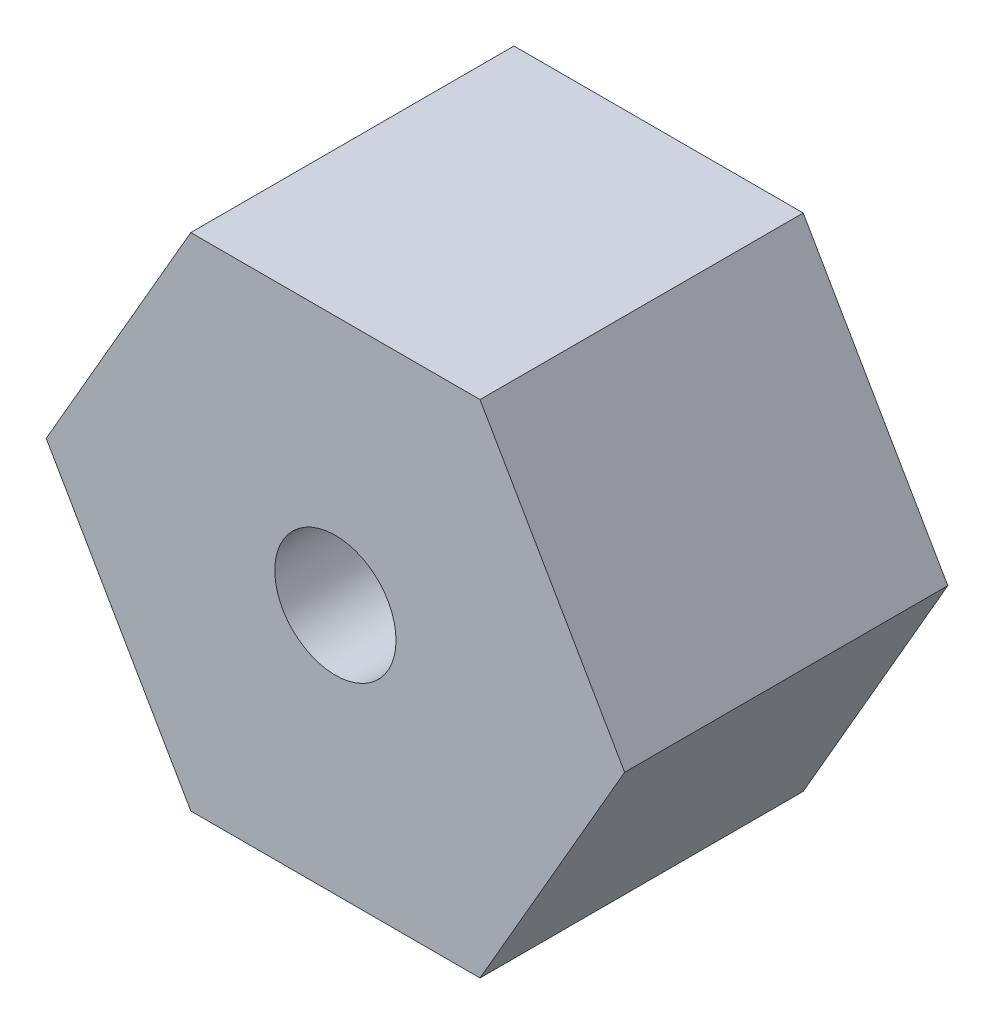
ISO-10303-21;
HEADER;
FILE_DESCRIPTION(('STEP AP214'),'2;1');
FILE_NAME('part.step','',(''),(''),'','','');
FILE_SCHEMA(('AUTOMOTIVE_DESIGN { 1 0 10303 214 1 1 1 1 }'));
ENDSEC;
DATA;
#1=APPLICATION_CONTEXT('core data for automotive mechanical design processes');
#2=APPLICATION_PROTOCOL_DEFINITION('international standard','automotive_design',2000,#1);
#3=PRODUCT_CONTEXT('',#1,'mechanical');
#4=PRODUCT('Part','Part','',(#3));
#5=PRODUCT_RELATED_PRODUCT_CATEGORY('part','',(#4));
#6=PRODUCT_DEFINITION_FORMATION('','',#4);
#7=PRODUCT_DEFINITION_CONTEXT('part definition',#1,'design');
#8=PRODUCT_DEFINITION('design','',#6,#7);
#9=PRODUCT_DEFINITION_SHAPE('','',#8);
#10=(LENGTH_UNIT() NAMED_UNIT(*) SI_UNIT(.MILLI.,.METRE.));
#11=(NAMED_UNIT(*) PLANE_ANGLE_UNIT() SI_UNIT($,.RADIAN.));
#12=(NAMED_UNIT(*) SI_UNIT($,.STERADIAN.) SOLID_ANGLE_UNIT());
#13=UNCERTAINTY_MEASURE_WITH_UNIT(LENGTH_MEASURE(1.E-05),#10,'distance_accuracy_value','');
#14=(GEOMETRIC_REPRESENTATION_CONTEXT(3) GLOBAL_UNCERTAINTY_ASSIGNED_CONTEXT((#13)) GLOBAL_UNIT_ASSIGNED_CONTEXT((#10,
#11,#12)) REPRESENTATION_CONTEXT('',''));
#15=CARTESIAN_POINT('',(0.,0.,0.));
#16=DIRECTION('',(0.,0.,1.));
#17=DIRECTION('',(1.,0.,0.));
#18=AXIS2_PLACEMENT_3D('',#15,#16,#17);
#19=CARTESIAN_POINT('',(0.,0.,8.));
#20=DIRECTION('',(0.,0.,-1.));
#21=DIRECTION('',(-1.,0.,0.));
#22=AXIS2_PLACEMENT_3D('',#19,#20,#21);
#23=PLANE('',#22);
#24=DIRECTION('',(-0.5,-0.866025403784439,0.));
#25=VECTOR('',#24,1.);
#26=CARTESIAN_POINT('',(-7.15914333795136,0.,8.));
#27=LINE('',#26,#25);
#28=CARTESIAN_POINT('',(-3.57957166897568,6.2,8.));
#29=VERTEX_POINT('',#28);
#30=CARTESIAN_POINT('',(-7.15914333795136,0.,8.));
#31=VERTEX_POINT('',#30);
#32=EDGE_CURVE('E130',#29,#31,#27,.T.);
#33=ORIENTED_EDGE('',*,*,#32,.T.);
#34=DIRECTION('',(0.5,-0.866025403784439,0.));
#35=VECTOR('',#34,1.);
#36=CARTESIAN_POINT('',(-3.57957166897568,-6.2,8.));
#37=LINE('',#36,#35);
#38=CARTESIAN_POINT('',(-3.57957166897568,-6.2,8.));
#39=VERTEX_POINT('',#38);
#40=EDGE_CURVE('E88',#31,#39,#37,.T.);
#41=ORIENTED_EDGE('',*,*,#40,.T.);
#42=DIRECTION('',(1.,0.,0.));
#43=VECTOR('',#42,1.);
#44=CARTESIAN_POINT('',(3.57957166897568,-6.2,8.));
#45=LINE('',#44,#43);
#46=CARTESIAN_POINT('',(3.57957166897568,-6.2,8.));
#47=VERTEX_POINT('',#46);
#48=EDGE_CURVE('E101',#39,#47,#45,.T.);
#49=ORIENTED_EDGE('',*,*,#48,.T.);
#50=DIRECTION('',(0.5,0.866025403784439,0.));
#51=VECTOR('',#50,1.);
#52=CARTESIAN_POINT('',(7.15914333795136,0.,8.));
#53=LINE('',#52,#51);
#54=CARTESIAN_POINT('',(7.15914333795136,0.,8.));
#55=VERTEX_POINT('',#54);
#56=EDGE_CURVE('E95',#47,#55,#53,.T.);
#57=ORIENTED_EDGE('',*,*,#56,.T.);
#58=DIRECTION('',(-0.5,0.866025403784439,0.));
#59=VECTOR('',#58,1.);
#60=CARTESIAN_POINT('',(3.57957166897568,6.2,8.));
#61=LINE('',#60,#59);
#62=CARTESIAN_POINT('',(3.57957166897568,6.2,8.));
#63=VERTEX_POINT('',#62);
#64=EDGE_CURVE('E99',#55,#63,#61,.T.);
#65=ORIENTED_EDGE('',*,*,#64,.T.);
#66=DIRECTION('',(-1.,0.,0.));
#67=VECTOR('',#66,1.);
#68=CARTESIAN_POINT('',(-3.57957166897568,6.2,8.));
#69=LINE('',#68,#67);
#70=EDGE_CURVE('E51',#63,#29,#69,.T.);
#71=ORIENTED_EDGE('',*,*,#70,.T.);
#72=EDGE_LOOP('',(#33,#41,#49,#57,#65,#71));
#73=FACE_BOUND('',#72,.T.);
#74=CARTESIAN_POINT('',(0.,0.,8.));
#75=DIRECTION('',(0.,0.,1.));
#76=DIRECTION('',(1.,0.,0.));
#77=AXIS2_PLACEMENT_3D('',#74,#75,#76);
#78=CIRCLE('',#77,1.5);
#79=CARTESIAN_POINT('',(1.5,0.,8.));
#80=VERTEX_POINT('',#79);
#81=EDGE_CURVE('E123',#80,#80,#78,.T.);
#82=ORIENTED_EDGE('',*,*,#81,.F.);
#83=EDGE_LOOP('',(#82));
#84=FACE_BOUND('',#83,.T.);
#85=ADVANCED_FACE('F34',(#73,#84),#23,.F.);
#86=CARTESIAN_POINT('',(0.,0.,0.));
#87=DIRECTION('',(0.,0.,-1.));
#88=DIRECTION('',(-1.,0.,0.));
#89=AXIS2_PLACEMENT_3D('',#86,#87,#88);
#90=PLANE('',#89);
#91=DIRECTION('',(-0.5,-0.866025403784439,0.));
#92=VECTOR('',#91,1.);
#93=CARTESIAN_POINT('',(-7.15914333795136,0.,0.));
#94=LINE('',#93,#92);
#95=CARTESIAN_POINT('',(-3.57957166897568,6.2,0.));
#96=VERTEX_POINT('',#95);
#97=CARTESIAN_POINT('',(-7.15914333795136,0.,0.));
#98=VERTEX_POINT('',#97);
#99=EDGE_CURVE('E119',#96,#98,#94,.T.);
#100=ORIENTED_EDGE('',*,*,#99,.F.);
#101=DIRECTION('',(-1.,0.,0.));
#102=VECTOR('',#101,1.);
#103=CARTESIAN_POINT('',(-3.57957166897568,6.2,0.));
#104=LINE('',#103,#102);
#105=CARTESIAN_POINT('',(3.57957166897568,6.2,0.));
#106=VERTEX_POINT('',#105);
#107=EDGE_CURVE('E80',#106,#96,#104,.T.);
#108=ORIENTED_EDGE('',*,*,#107,.F.);
#109=DIRECTION('',(-0.5,0.866025403784439,0.));
#110=VECTOR('',#109,1.);
#111=CARTESIAN_POINT('',(3.57957166897568,6.2,0.));
#112=LINE('',#111,#110);
#113=CARTESIAN_POINT('',(7.15914333795136,0.,0.));
#114=VERTEX_POINT('',#113);
#115=EDGE_CURVE('E74',#114,#106,#112,.T.);
#116=ORIENTED_EDGE('',*,*,#115,.F.);
#117=DIRECTION('',(0.5,0.866025403784439,0.));
#118=VECTOR('',#117,1.);
#119=CARTESIAN_POINT('',(7.15914333795136,0.,0.));
#120=LINE('',#119,#118);
#121=CARTESIAN_POINT('',(3.57957166897568,-6.2,0.));
#122=VERTEX_POINT('',#121);
#123=EDGE_CURVE('E109',#122,#114,#120,.T.);
#124=ORIENTED_EDGE('',*,*,#123,.F.);
#125=DIRECTION('',(1.,0.,0.));
#126=VECTOR('',#125,1.);
#127=CARTESIAN_POINT('',(3.57957166897568,-6.2,0.));
#128=LINE('',#127,#126);
#129=CARTESIAN_POINT('',(-3.57957166897568,-6.2,0.));
#130=VERTEX_POINT('',#129);
#131=EDGE_CURVE('E125',#130,#122,#128,.T.);
#132=ORIENTED_EDGE('',*,*,#131,.F.);
#133=DIRECTION('',(0.5,-0.866025403784439,0.));
#134=VECTOR('',#133,1.);
#135=CARTESIAN_POINT('',(-3.57957166897568,-6.2,0.));
#136=LINE('',#135,#134);
#137=EDGE_CURVE('E122',#98,#130,#136,.T.);
#138=ORIENTED_EDGE('',*,*,#137,.F.);
#139=EDGE_LOOP('',(#100,#108,#116,#124,#132,#138));
#140=FACE_BOUND('',#139,.T.);
#141=CARTESIAN_POINT('',(0.,0.,0.));
#142=DIRECTION('',(0.,0.,1.));
#143=DIRECTION('',(1.,0.,0.));
#144=AXIS2_PLACEMENT_3D('',#141,#142,#143);
#145=CIRCLE('',#144,1.5);
#146=CARTESIAN_POINT('',(1.5,0.,0.));
#147=VERTEX_POINT('',#146);
#148=EDGE_CURVE('E223',#147,#147,#145,.T.);
#149=ORIENTED_EDGE('',*,*,#148,.T.);
#150=EDGE_LOOP('',(#149));
#151=FACE_BOUND('',#150,.T.);
#152=ADVANCED_FACE('F139',(#140,#151),#90,.T.);
#153=CARTESIAN_POINT('',(-7.15914333795136,0.,8.));
#154=DIRECTION('',(0.866025403784439,-0.5,0.));
#155=DIRECTION('',(0.5,0.866025403784439,0.));
#156=AXIS2_PLACEMENT_3D('',#153,#154,#155);
#157=PLANE('',#156);
#158=ORIENTED_EDGE('',*,*,#99,.T.);
#159=DIRECTION('',(0.,0.,-1.));
#160=VECTOR('',#159,1.);
#161=CARTESIAN_POINT('',(-7.15914333795136,0.,8.));
#162=LINE('',#161,#160);
#163=EDGE_CURVE('E11',#31,#98,#162,.T.);
#164=ORIENTED_EDGE('',*,*,#163,.F.);
#165=ORIENTED_EDGE('',*,*,#32,.F.);
#166=DIRECTION('',(0.,0.,-1.));
#167=VECTOR('',#166,1.);
#168=CARTESIAN_POINT('',(-3.57957166897568,6.2,8.));
#169=LINE('',#168,#167);
#170=EDGE_CURVE('E115',#29,#96,#169,.T.);
#171=ORIENTED_EDGE('',*,*,#170,.T.);
#172=EDGE_LOOP('',(#158,#164,#165,#171));
#173=FACE_BOUND('',#172,.T.);
#174=ADVANCED_FACE('F36',(#173),#157,.F.);
#175=CARTESIAN_POINT('',(-3.57957166897568,-6.2,8.));
#176=DIRECTION('',(0.866025403784439,0.5,0.));
#177=DIRECTION('',(-0.5,0.866025403784439,0.));
#178=AXIS2_PLACEMENT_3D('',#175,#176,#177);
#179=PLANE('',#178);
#180=ORIENTED_EDGE('',*,*,#137,.T.);
#181=DIRECTION('',(0.,0.,-1.));
#182=VECTOR('',#181,1.);
#183=CARTESIAN_POINT('',(-3.57957166897568,-6.2,8.));
#184=LINE('',#183,#182);
#185=EDGE_CURVE('E43',#39,#130,#184,.T.);
#186=ORIENTED_EDGE('',*,*,#185,.F.);
#187=ORIENTED_EDGE('',*,*,#40,.F.);
#188=ORIENTED_EDGE('',*,*,#163,.T.);
#189=EDGE_LOOP('',(#180,#186,#187,#188));
#190=FACE_BOUND('',#189,.T.);
#191=ADVANCED_FACE('F164',(#190),#179,.F.);
#192=CARTESIAN_POINT('',(3.57957166897568,-6.2,8.));
#193=DIRECTION('',(0.,1.,0.));
#194=DIRECTION('',(0.,0.,1.));
#195=AXIS2_PLACEMENT_3D('',#192,#193,#194);
#196=PLANE('',#195);
#197=ORIENTED_EDGE('',*,*,#131,.T.);
#198=DIRECTION('',(0.,0.,-1.));
#199=VECTOR('',#198,1.);
#200=CARTESIAN_POINT('',(3.57957166897568,-6.2,8.));
#201=LINE('',#200,#199);
#202=EDGE_CURVE('E110',#47,#122,#201,.T.);
#203=ORIENTED_EDGE('',*,*,#202,.F.);
#204=ORIENTED_EDGE('',*,*,#48,.F.);
#205=ORIENTED_EDGE('',*,*,#185,.T.);
#206=EDGE_LOOP('',(#197,#203,#204,#205));
#207=FACE_BOUND('',#206,.T.);
#208=ADVANCED_FACE('F136',(#207),#196,.F.);
#209=CARTESIAN_POINT('',(7.15914333795136,0.,8.));
#210=DIRECTION('',(-0.866025403784439,0.5,0.));
#211=DIRECTION('',(-0.5,-0.866025403784439,0.));
#212=AXIS2_PLACEMENT_3D('',#209,#210,#211);
#213=PLANE('',#212);
#214=ORIENTED_EDGE('',*,*,#123,.T.);
#215=DIRECTION('',(0.,0.,-1.));
#216=VECTOR('',#215,1.);
#217=CARTESIAN_POINT('',(7.15914333795136,0.,8.));
#218=LINE('',#217,#216);
#219=EDGE_CURVE('E106',#55,#114,#218,.T.);
#220=ORIENTED_EDGE('',*,*,#219,.F.);
#221=ORIENTED_EDGE('',*,*,#56,.F.);
#222=ORIENTED_EDGE('',*,*,#202,.T.);
#223=EDGE_LOOP('',(#214,#220,#221,#222));
#224=FACE_BOUND('',#223,.T.);
#225=ADVANCED_FACE('F107',(#224),#213,.F.);
#226=CARTESIAN_POINT('',(3.57957166897568,6.2,8.));
#227=DIRECTION('',(-0.866025403784439,-0.5,0.));
#228=DIRECTION('',(0.5,-0.866025403784439,0.));
#229=AXIS2_PLACEMENT_3D('',#226,#227,#228);
#230=PLANE('',#229);
#231=ORIENTED_EDGE('',*,*,#115,.T.);
#232=DIRECTION('',(0.,0.,-1.));
#233=VECTOR('',#232,1.);
#234=CARTESIAN_POINT('',(3.57957166897568,6.2,8.));
#235=LINE('',#234,#233);
#236=EDGE_CURVE('E111',#63,#106,#235,.T.);
#237=ORIENTED_EDGE('',*,*,#236,.F.);
#238=ORIENTED_EDGE('',*,*,#64,.F.);
#239=ORIENTED_EDGE('',*,*,#219,.T.);
#240=EDGE_LOOP('',(#231,#237,#238,#239));
#241=FACE_BOUND('',#240,.T.);
#242=ADVANCED_FACE('F113',(#241),#230,.F.);
#243=CARTESIAN_POINT('',(-3.57957166897568,6.2,8.));
#244=DIRECTION('',(0.,-1.,0.));
#245=DIRECTION('',(0.,0.,-1.));
#246=AXIS2_PLACEMENT_3D('',#243,#244,#245);
#247=PLANE('',#246);
#248=ORIENTED_EDGE('',*,*,#107,.T.);
#249=ORIENTED_EDGE('',*,*,#170,.F.);
#250=ORIENTED_EDGE('',*,*,#70,.F.);
#251=ORIENTED_EDGE('',*,*,#236,.T.);
#252=EDGE_LOOP('',(#248,#249,#250,#251));
#253=FACE_BOUND('',#252,.T.);
#254=ADVANCED_FACE('F144',(#253),#247,.F.);
#255=CARTESIAN_POINT('',(0.,0.,8.));
#256=DIRECTION('',(0.,0.,-1.));
#257=DIRECTION('',(-1.,0.,0.));
#258=AXIS2_PLACEMENT_3D('',#255,#256,#257);
#259=CYLINDRICAL_SURFACE('',#258,1.5);
#260=ORIENTED_EDGE('',*,*,#81,.T.);
#261=EDGE_LOOP('',(#260));
#262=FACE_BOUND('',#261,.T.);
#263=ORIENTED_EDGE('',*,*,#148,.F.);
#264=EDGE_LOOP('',(#263));
#265=FACE_BOUND('',#264,.T.);
#266=ADVANCED_FACE('F146',(#262,#265),#259,.F.);
#267=CLOSED_SHELL('',(#85,#152,#174,#191,#208,#225,#242,#254,#266));
#268=MANIFOLD_SOLID_BREP('B2',#267);
#269=ADVANCED_BREP_SHAPE_REPRESENTATION('',(#18,#268),#14);
#270=SHAPE_DEFINITION_REPRESENTATION(#9,#269);
ENDSEC;
END-ISO-10303-21;
